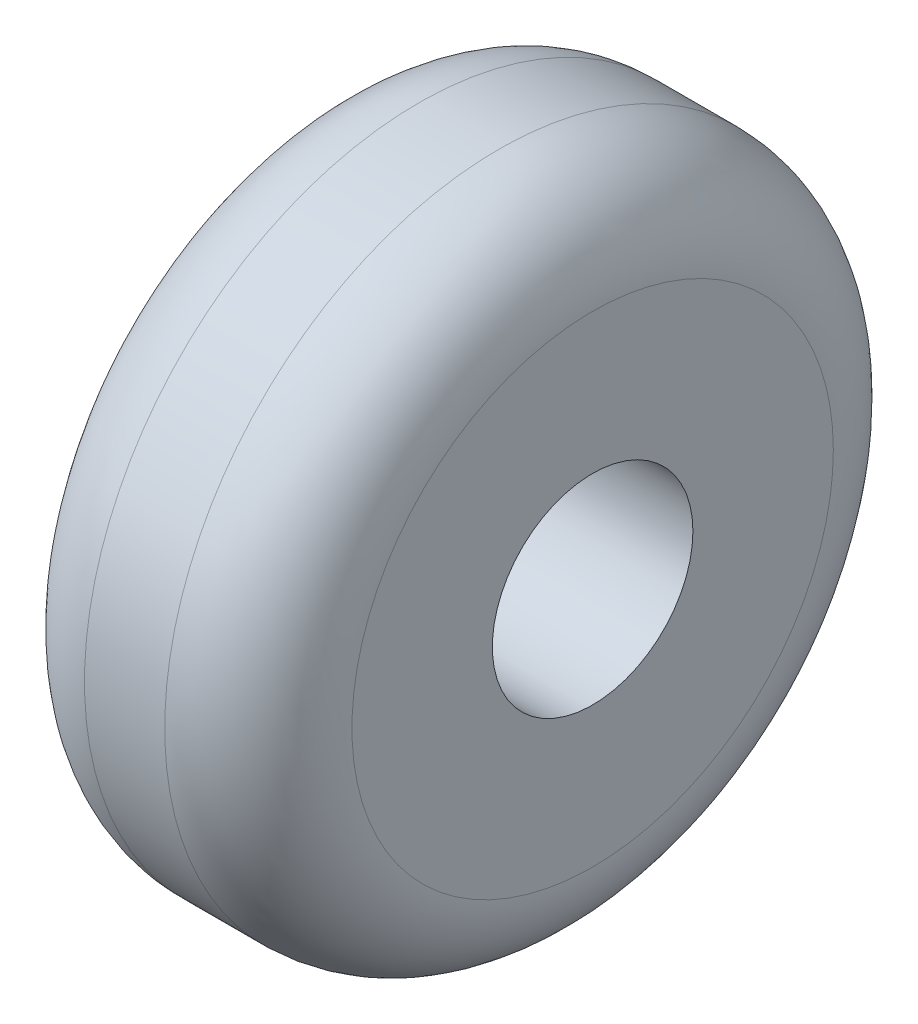
ISO-10303-21;
HEADER;
FILE_DESCRIPTION(('STEP AP214'),'2;1');
FILE_NAME('part.step','',(''),(''),'','','');
FILE_SCHEMA(('AUTOMOTIVE_DESIGN { 1 0 10303 214 1 1 1 1 }'));
ENDSEC;
DATA;
#1=APPLICATION_CONTEXT('core data for automotive mechanical design processes');
#2=APPLICATION_PROTOCOL_DEFINITION('international standard','automotive_design',2000,#1);
#3=PRODUCT_CONTEXT('',#1,'mechanical');
#4=PRODUCT('Part','Part','',(#3));
#5=PRODUCT_RELATED_PRODUCT_CATEGORY('part','',(#4));
#6=PRODUCT_DEFINITION_FORMATION('','',#4);
#7=PRODUCT_DEFINITION_CONTEXT('part definition',#1,'design');
#8=PRODUCT_DEFINITION('design','',#6,#7);
#9=PRODUCT_DEFINITION_SHAPE('','',#8);
#10=(LENGTH_UNIT() NAMED_UNIT(*) SI_UNIT(.MILLI.,.METRE.));
#11=(NAMED_UNIT(*) PLANE_ANGLE_UNIT() SI_UNIT($,.RADIAN.));
#12=(NAMED_UNIT(*) SI_UNIT($,.STERADIAN.) SOLID_ANGLE_UNIT());
#13=UNCERTAINTY_MEASURE_WITH_UNIT(LENGTH_MEASURE(1.E-05),#10,'distance_accuracy_value','');
#14=(GEOMETRIC_REPRESENTATION_CONTEXT(3) GLOBAL_UNCERTAINTY_ASSIGNED_CONTEXT((#13)) GLOBAL_UNIT_ASSIGNED_CONTEXT((#10,
#11,#12)) REPRESENTATION_CONTEXT('',''));
#15=CARTESIAN_POINT('',(0.,0.,0.));
#16=DIRECTION('',(0.,0.,1.));
#17=DIRECTION('',(1.,0.,0.));
#18=AXIS2_PLACEMENT_3D('',#15,#16,#17);
#19=CARTESIAN_POINT('',(1.,0.,0.));
#20=DIRECTION('',(1.,0.,0.));
#21=DIRECTION('',(0.,0.,-1.));
#22=AXIS2_PLACEMENT_3D('',#19,#20,#21);
#23=PLANE('',#22);
#24=CARTESIAN_POINT('',(1.,0.,0.));
#25=DIRECTION('',(1.,0.,0.));
#26=DIRECTION('',(0.,0.,-1.));
#27=AXIS2_PLACEMENT_3D('',#24,#25,#26);
#28=CIRCLE('',#27,1.8);
#29=CARTESIAN_POINT('',(1.,0.,-1.8));
#30=VERTEX_POINT('',#29);
#31=EDGE_CURVE('E10',#30,#30,#28,.T.);
#32=ORIENTED_EDGE('',*,*,#31,.T.);
#33=EDGE_LOOP('',(#32));
#34=FACE_BOUND('',#33,.T.);
#35=CARTESIAN_POINT('',(1.,0.,0.));
#36=DIRECTION('',(1.,0.,0.));
#37=DIRECTION('',(0.,0.,-1.));
#38=AXIS2_PLACEMENT_3D('',#35,#36,#37);
#39=CIRCLE('',#38,0.75);
#40=CARTESIAN_POINT('',(1.,0.,-0.75));
#41=VERTEX_POINT('',#40);
#42=EDGE_CURVE('E61',#41,#41,#39,.T.);
#43=ORIENTED_EDGE('',*,*,#42,.F.);
#44=EDGE_LOOP('',(#43));
#45=FACE_BOUND('',#44,.T.);
#46=ADVANCED_FACE('F37',(#34,#45),#23,.T.);
#47=CARTESIAN_POINT('',(-1.,0.,0.));
#48=DIRECTION('',(1.,0.,0.));
#49=DIRECTION('',(0.,0.,-1.));
#50=AXIS2_PLACEMENT_3D('',#47,#48,#49);
#51=PLANE('',#50);
#52=CARTESIAN_POINT('',(-1.,0.,0.));
#53=DIRECTION('',(1.,0.,0.));
#54=DIRECTION('',(0.,0.,-1.));
#55=AXIS2_PLACEMENT_3D('',#52,#53,#54);
#56=CIRCLE('',#55,1.8);
#57=CARTESIAN_POINT('',(-1.,0.,-1.8));
#58=VERTEX_POINT('',#57);
#59=EDGE_CURVE('E45',#58,#58,#56,.F.);
#60=ORIENTED_EDGE('',*,*,#59,.T.);
#61=EDGE_LOOP('',(#60));
#62=FACE_BOUND('',#61,.T.);
#63=CARTESIAN_POINT('',(-1.,0.,0.));
#64=DIRECTION('',(1.,0.,0.));
#65=DIRECTION('',(0.,0.,-1.));
#66=AXIS2_PLACEMENT_3D('',#63,#64,#65);
#67=CIRCLE('',#66,0.75);
#68=CARTESIAN_POINT('',(-1.,0.,-0.75));
#69=VERTEX_POINT('',#68);
#70=EDGE_CURVE('E62',#69,#69,#67,.T.);
#71=ORIENTED_EDGE('',*,*,#70,.T.);
#72=EDGE_LOOP('',(#71));
#73=FACE_BOUND('',#72,.T.);
#74=ADVANCED_FACE('F74',(#62,#73),#51,.F.);
#75=CARTESIAN_POINT('',(1.,0.,0.));
#76=DIRECTION('',(-1.,0.,0.));
#77=DIRECTION('',(0.,0.,1.));
#78=AXIS2_PLACEMENT_3D('',#75,#76,#77);
#79=CYLINDRICAL_SURFACE('',#78,2.5);
#80=CARTESIAN_POINT('',(-0.3,0.,0.));
#81=DIRECTION('',(1.,0.,0.));
#82=DIRECTION('',(0.,0.,-1.));
#83=AXIS2_PLACEMENT_3D('',#80,#81,#82);
#84=CIRCLE('',#83,2.5);
#85=CARTESIAN_POINT('',(-0.3,0.,-2.5));
#86=VERTEX_POINT('',#85);
#87=EDGE_CURVE('E50',#86,#86,#84,.T.);
#88=ORIENTED_EDGE('',*,*,#87,.T.);
#89=EDGE_LOOP('',(#88));
#90=FACE_BOUND('',#89,.T.);
#91=CARTESIAN_POINT('',(0.3,0.,0.));
#92=DIRECTION('',(1.,0.,0.));
#93=DIRECTION('',(0.,0.,-1.));
#94=AXIS2_PLACEMENT_3D('',#91,#92,#93);
#95=CIRCLE('',#94,2.5);
#96=CARTESIAN_POINT('',(0.3,0.,-2.5));
#97=VERTEX_POINT('',#96);
#98=EDGE_CURVE('E55',#97,#97,#95,.F.);
#99=ORIENTED_EDGE('',*,*,#98,.T.);
#100=EDGE_LOOP('',(#99));
#101=FACE_BOUND('',#100,.T.);
#102=ADVANCED_FACE('F79',(#90,#101),#79,.T.);
#103=CARTESIAN_POINT('',(1.,0.,0.));
#104=DIRECTION('',(-1.,0.,0.));
#105=DIRECTION('',(0.,0.,1.));
#106=AXIS2_PLACEMENT_3D('',#103,#104,#105);
#107=CYLINDRICAL_SURFACE('',#106,0.75);
#108=ORIENTED_EDGE('',*,*,#42,.T.);
#109=EDGE_LOOP('',(#108));
#110=FACE_BOUND('',#109,.T.);
#111=ORIENTED_EDGE('',*,*,#70,.F.);
#112=EDGE_LOOP('',(#111));
#113=FACE_BOUND('',#112,.T.);
#114=ADVANCED_FACE('F70',(#110,#113),#107,.F.);
#115=CARTESIAN_POINT('',(-0.3,0.,0.));
#116=DIRECTION('',(1.,0.,0.));
#117=DIRECTION('',(0.,0.,-1.));
#118=AXIS2_PLACEMENT_3D('',#115,#116,#117);
#119=TOROIDAL_SURFACE('',#118,1.8,0.7);
#120=ORIENTED_EDGE('',*,*,#59,.F.);
#121=EDGE_LOOP('',(#120));
#122=FACE_BOUND('',#121,.T.);
#123=ORIENTED_EDGE('',*,*,#87,.F.);
#124=EDGE_LOOP('',(#123));
#125=FACE_BOUND('',#124,.T.);
#126=ADVANCED_FACE('F85',(#122,#125),#119,.T.);
#127=CARTESIAN_POINT('',(0.3,0.,0.));
#128=DIRECTION('',(1.,0.,0.));
#129=DIRECTION('',(0.,0.,-1.));
#130=AXIS2_PLACEMENT_3D('',#127,#128,#129);
#131=TOROIDAL_SURFACE('',#130,1.8,0.7);
#132=ORIENTED_EDGE('',*,*,#98,.F.);
#133=EDGE_LOOP('',(#132));
#134=FACE_BOUND('',#133,.T.);
#135=ORIENTED_EDGE('',*,*,#31,.F.);
#136=EDGE_LOOP('',(#135));
#137=FACE_BOUND('',#136,.T.);
#138=ADVANCED_FACE('F39',(#134,#137),#131,.T.);
#139=CLOSED_SHELL('',(#46,#74,#102,#114,#126,#138));
#140=MANIFOLD_SOLID_BREP('B2',#139);
#141=ADVANCED_BREP_SHAPE_REPRESENTATION('',(#18,#140),#14);
#142=SHAPE_DEFINITION_REPRESENTATION(#9,#141);
ENDSEC;
END-ISO-10303-21;
